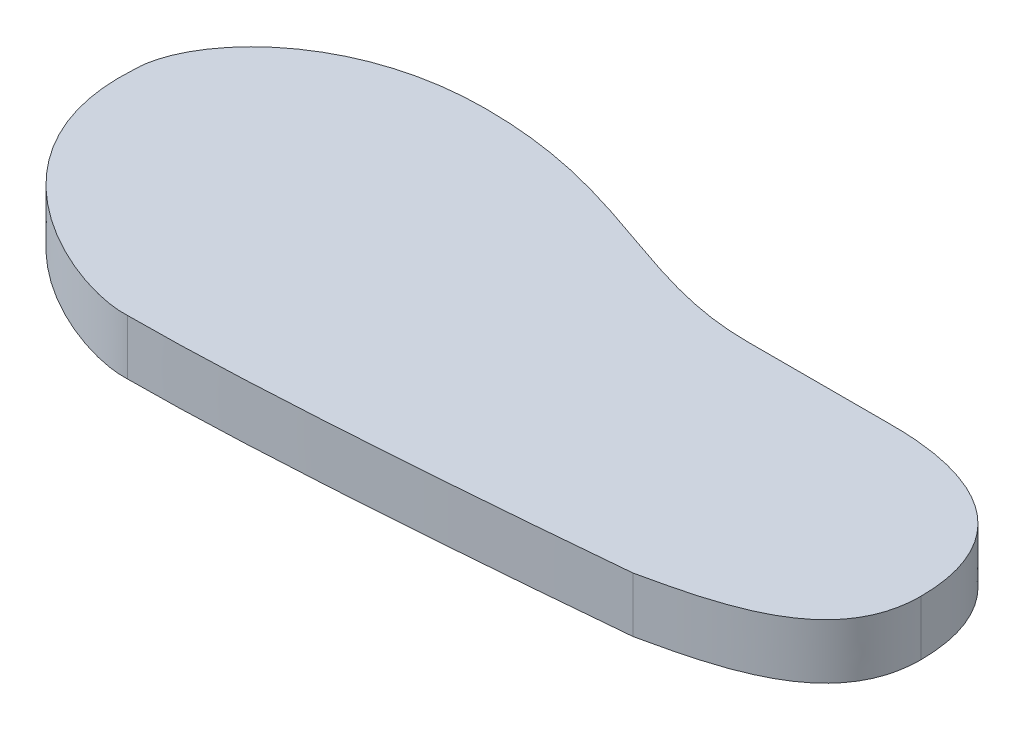
ISO-10303-21;
HEADER;
FILE_DESCRIPTION(('STEP AP214'),'2;1');
FILE_NAME('part.step','',(''),(''),'','','');
FILE_SCHEMA(('AUTOMOTIVE_DESIGN { 1 0 10303 214 1 1 1 1 }'));
ENDSEC;
DATA;
#1=APPLICATION_CONTEXT('core data for automotive mechanical design processes');
#2=APPLICATION_PROTOCOL_DEFINITION('international standard','automotive_design',2000,#1);
#3=PRODUCT_CONTEXT('',#1,'mechanical');
#4=PRODUCT('Part','Part','',(#3));
#5=PRODUCT_RELATED_PRODUCT_CATEGORY('part','',(#4));
#6=PRODUCT_DEFINITION_FORMATION('','',#4);
#7=PRODUCT_DEFINITION_CONTEXT('part definition',#1,'design');
#8=PRODUCT_DEFINITION('design','',#6,#7);
#9=PRODUCT_DEFINITION_SHAPE('','',#8);
#10=(LENGTH_UNIT() NAMED_UNIT(*) SI_UNIT(.MILLI.,.METRE.));
#11=(NAMED_UNIT(*) PLANE_ANGLE_UNIT() SI_UNIT($,.RADIAN.));
#12=(NAMED_UNIT(*) SI_UNIT($,.STERADIAN.) SOLID_ANGLE_UNIT());
#13=UNCERTAINTY_MEASURE_WITH_UNIT(LENGTH_MEASURE(1.E-05),#10,'distance_accuracy_value','');
#14=(GEOMETRIC_REPRESENTATION_CONTEXT(3) GLOBAL_UNCERTAINTY_ASSIGNED_CONTEXT((#13)) GLOBAL_UNIT_ASSIGNED_CONTEXT((#10,
#11,#12)) REPRESENTATION_CONTEXT('',''));
#15=CARTESIAN_POINT('',(0.,0.,0.));
#16=DIRECTION('',(0.,0.,1.));
#17=DIRECTION('',(1.,0.,0.));
#18=AXIS2_PLACEMENT_3D('',#15,#16,#17);
#19=CARTESIAN_POINT('',(-26.,10.,-24.3));
#20=CARTESIAN_POINT('',(-46.3736075901508,10.,-24.3));
#21=CARTESIAN_POINT('',(-60.2233674091947,10.,-37.2));
#22=CARTESIAN_POINT('',(-86.5,10.,-37.2));
#23=B_SPLINE_CURVE_WITH_KNOTS('',3,(#19,#20,#21,#22),.UNSPECIFIED.,.F.,.F.,(4,4),(0.,1.),.UNSPECIFIED.);
#24=DIRECTION('',(0.,-1.,0.));
#25=VECTOR('',#24,1.);
#26=SURFACE_OF_LINEAR_EXTRUSION('',#23,#25);
#27=CARTESIAN_POINT('',(-26.,0.,-24.3));
#28=CARTESIAN_POINT('',(-46.3736075901508,0.,-24.3));
#29=CARTESIAN_POINT('',(-60.2233674091947,0.,-37.2));
#30=CARTESIAN_POINT('',(-86.5,0.,-37.2));
#31=B_SPLINE_CURVE_WITH_KNOTS('',3,(#27,#28,#29,#30),.UNSPECIFIED.,.F.,.F.,(4,4),(0.,1.),.UNSPECIFIED.);
#32=CARTESIAN_POINT('',(-26.,0.,-24.3));
#33=VERTEX_POINT('',#32);
#34=CARTESIAN_POINT('',(-86.5,0.,-37.2));
#35=VERTEX_POINT('',#34);
#36=EDGE_CURVE('E188',#33,#35,#31,.T.);
#37=ORIENTED_EDGE('',*,*,#36,.T.);
#38=DIRECTION('',(0.,-1.,0.));
#39=VECTOR('',#38,1.);
#40=CARTESIAN_POINT('',(-86.5,10.,-37.2));
#41=LINE('',#40,#39);
#42=CARTESIAN_POINT('',(-86.5,10.,-37.2));
#43=VERTEX_POINT('',#42);
#44=EDGE_CURVE('E11',#43,#35,#41,.T.);
#45=ORIENTED_EDGE('',*,*,#44,.F.);
#46=CARTESIAN_POINT('',(-26.,10.,-24.3));
#47=VERTEX_POINT('',#46);
#48=EDGE_CURVE('E164',#47,#43,#23,.T.);
#49=ORIENTED_EDGE('',*,*,#48,.F.);
#50=DIRECTION('',(0.,-1.,0.));
#51=VECTOR('',#50,1.);
#52=CARTESIAN_POINT('',(-26.,10.,-24.3));
#53=LINE('',#52,#51);
#54=EDGE_CURVE('E120',#47,#33,#53,.T.);
#55=ORIENTED_EDGE('',*,*,#54,.T.);
#56=EDGE_LOOP('',(#37,#45,#49,#55));
#57=FACE_BOUND('',#56,.T.);
#58=ADVANCED_FACE('F33',(#57),#26,.F.);
#59=CARTESIAN_POINT('',(-86.5,10.,-37.2));
#60=CARTESIAN_POINT('',(-111.583343569162,10.,-37.2));
#61=CARTESIAN_POINT('',(-124.6,10.,-21.1459181805491));
#62=CARTESIAN_POINT('',(-124.6,10.,-11.6));
#63=B_SPLINE_CURVE_WITH_KNOTS('',3,(#59,#60,#61,#62),.UNSPECIFIED.,.F.,.F.,(4,4),(0.,1.),.UNSPECIFIED.);
#64=DIRECTION('',(0.,-1.,0.));
#65=VECTOR('',#64,1.);
#66=SURFACE_OF_LINEAR_EXTRUSION('',#63,#65);
#67=CARTESIAN_POINT('',(-86.5,0.,-37.2));
#68=CARTESIAN_POINT('',(-111.583343569162,0.,-37.2));
#69=CARTESIAN_POINT('',(-124.6,0.,-21.1459181805491));
#70=CARTESIAN_POINT('',(-124.6,0.,-11.6));
#71=B_SPLINE_CURVE_WITH_KNOTS('',3,(#67,#68,#69,#70),.UNSPECIFIED.,.F.,.F.,(4,4),(0.,1.),.UNSPECIFIED.);
#72=CARTESIAN_POINT('',(-124.6,0.,-11.6));
#73=VERTEX_POINT('',#72);
#74=EDGE_CURVE('E179',#35,#73,#71,.T.);
#75=ORIENTED_EDGE('',*,*,#74,.T.);
#76=DIRECTION('',(0.,-1.,0.));
#77=VECTOR('',#76,1.);
#78=CARTESIAN_POINT('',(-124.6,10.,-11.6));
#79=LINE('',#78,#77);
#80=CARTESIAN_POINT('',(-124.6,10.,-11.6));
#81=VERTEX_POINT('',#80);
#82=EDGE_CURVE('E42',#81,#73,#79,.T.);
#83=ORIENTED_EDGE('',*,*,#82,.F.);
#84=EDGE_CURVE('E90',#43,#81,#63,.T.);
#85=ORIENTED_EDGE('',*,*,#84,.F.);
#86=ORIENTED_EDGE('',*,*,#44,.T.);
#87=EDGE_LOOP('',(#75,#83,#85,#86));
#88=FACE_BOUND('',#87,.T.);
#89=ADVANCED_FACE('F171',(#88),#66,.F.);
#90=CARTESIAN_POINT('',(-124.6,10.,-11.6));
#91=CARTESIAN_POINT('',(-126.645501881538,10.,15.9295647907661));
#92=CARTESIAN_POINT('',(-96.1691643712727,10.,28.4589253460756));
#93=CARTESIAN_POINT('',(-86.5,10.,27.9));
#94=B_SPLINE_CURVE_WITH_KNOTS('',3,(#90,#91,#92,#93),.UNSPECIFIED.,.F.,.F.,(4,4),(0.,1.),.UNSPECIFIED.);
#95=DIRECTION('',(0.,-1.,0.));
#96=VECTOR('',#95,1.);
#97=SURFACE_OF_LINEAR_EXTRUSION('',#94,#96);
#98=CARTESIAN_POINT('',(-124.6,0.,-11.6));
#99=CARTESIAN_POINT('',(-126.645501881538,0.,15.9295647907661));
#100=CARTESIAN_POINT('',(-96.1691643712727,0.,28.4589253460756));
#101=CARTESIAN_POINT('',(-86.5,0.,27.9));
#102=B_SPLINE_CURVE_WITH_KNOTS('',3,(#98,#99,#100,#101),.UNSPECIFIED.,.F.,.F.,(4,4),(0.,1.),.UNSPECIFIED.);
#103=CARTESIAN_POINT('',(-86.5,0.,27.9));
#104=VERTEX_POINT('',#103);
#105=EDGE_CURVE('E187',#73,#104,#102,.T.);
#106=ORIENTED_EDGE('',*,*,#105,.T.);
#107=DIRECTION('',(0.,-1.,0.));
#108=VECTOR('',#107,1.);
#109=CARTESIAN_POINT('',(-86.5,10.,27.9));
#110=LINE('',#109,#108);
#111=CARTESIAN_POINT('',(-86.5,10.,27.9));
#112=VERTEX_POINT('',#111);
#113=EDGE_CURVE('E192',#112,#104,#110,.T.);
#114=ORIENTED_EDGE('',*,*,#113,.F.);
#115=EDGE_CURVE('E150',#81,#112,#94,.T.);
#116=ORIENTED_EDGE('',*,*,#115,.F.);
#117=ORIENTED_EDGE('',*,*,#82,.T.);
#118=EDGE_LOOP('',(#106,#114,#116,#117));
#119=FACE_BOUND('',#118,.T.);
#120=ADVANCED_FACE('F144',(#119),#97,.F.);
#121=CARTESIAN_POINT('',(-86.5,10.,27.9));
#122=CARTESIAN_POINT('',(-58.7425919272787,10.,27.9));
#123=CARTESIAN_POINT('',(0.,10.,22.5));
#124=B_SPLINE_CURVE_WITH_KNOTS('',2,(#121,#122,#123),.UNSPECIFIED.,.F.,.F.,(3,3),(0.,1.),.UNSPECIFIED.);
#125=DIRECTION('',(0.,-1.,0.));
#126=VECTOR('',#125,1.);
#127=SURFACE_OF_LINEAR_EXTRUSION('',#124,#126);
#128=CARTESIAN_POINT('',(-86.5,0.,27.9));
#129=CARTESIAN_POINT('',(-58.7425919272787,0.,27.9));
#130=CARTESIAN_POINT('',(0.,0.,22.5));
#131=B_SPLINE_CURVE_WITH_KNOTS('',2,(#128,#129,#130),.UNSPECIFIED.,.F.,.F.,(3,3),(0.,1.),.UNSPECIFIED.);
#132=CARTESIAN_POINT('',(0.,0.,22.5));
#133=VERTEX_POINT('',#132);
#134=EDGE_CURVE('E195',#104,#133,#131,.T.);
#135=ORIENTED_EDGE('',*,*,#134,.T.);
#136=DIRECTION('',(0.,-1.,0.));
#137=VECTOR('',#136,1.);
#138=CARTESIAN_POINT('',(0.,10.,22.5));
#139=LINE('',#138,#137);
#140=CARTESIAN_POINT('',(0.,10.,22.5));
#141=VERTEX_POINT('',#140);
#142=EDGE_CURVE('E115',#141,#133,#139,.T.);
#143=ORIENTED_EDGE('',*,*,#142,.F.);
#144=EDGE_CURVE('E106',#112,#141,#124,.T.);
#145=ORIENTED_EDGE('',*,*,#144,.F.);
#146=ORIENTED_EDGE('',*,*,#113,.T.);
#147=EDGE_LOOP('',(#135,#143,#145,#146));
#148=FACE_BOUND('',#147,.T.);
#149=ADVANCED_FACE('F141',(#148),#127,.F.);
#150=CARTESIAN_POINT('',(0.,10.,22.5));
#151=CARTESIAN_POINT('',(12.7937826522867,10.,19.673675203613));
#152=CARTESIAN_POINT('',(29.8,10.,15.9033856721984));
#153=CARTESIAN_POINT('',(29.8,10.,0.));
#154=B_SPLINE_CURVE_WITH_KNOTS('',3,(#150,#151,#152,#153),.UNSPECIFIED.,.F.,.F.,(4,4),(0.,1.),.UNSPECIFIED.);
#155=DIRECTION('',(0.,-1.,0.));
#156=VECTOR('',#155,1.);
#157=SURFACE_OF_LINEAR_EXTRUSION('',#154,#156);
#158=CARTESIAN_POINT('',(0.,0.,22.5));
#159=CARTESIAN_POINT('',(12.7937826522867,0.,19.673675203613));
#160=CARTESIAN_POINT('',(29.8,0.,15.9033856721984));
#161=CARTESIAN_POINT('',(29.8,0.,0.));
#162=B_SPLINE_CURVE_WITH_KNOTS('',3,(#158,#159,#160,#161),.UNSPECIFIED.,.F.,.F.,(4,4),(0.,1.),.UNSPECIFIED.);
#163=CARTESIAN_POINT('',(29.8,0.,0.));
#164=VERTEX_POINT('',#163);
#165=EDGE_CURVE('E114',#133,#164,#162,.T.);
#166=ORIENTED_EDGE('',*,*,#165,.T.);
#167=DIRECTION('',(0.,-1.,0.));
#168=VECTOR('',#167,1.);
#169=CARTESIAN_POINT('',(29.8,10.,0.));
#170=LINE('',#169,#168);
#171=CARTESIAN_POINT('',(29.8,10.,0.));
#172=VERTEX_POINT('',#171);
#173=EDGE_CURVE('E111',#172,#164,#170,.T.);
#174=ORIENTED_EDGE('',*,*,#173,.F.);
#175=EDGE_CURVE('E100',#141,#172,#154,.T.);
#176=ORIENTED_EDGE('',*,*,#175,.F.);
#177=ORIENTED_EDGE('',*,*,#142,.T.);
#178=EDGE_LOOP('',(#166,#174,#176,#177));
#179=FACE_BOUND('',#178,.T.);
#180=ADVANCED_FACE('F112',(#179),#157,.F.);
#181=CARTESIAN_POINT('',(29.8,10.,0.));
#182=CARTESIAN_POINT('',(29.8,10.,-14.0989616041096));
#183=CARTESIAN_POINT('',(20.6838322885155,10.,-24.3847138108634));
#184=CARTESIAN_POINT('',(0.,10.,-24.3));
#185=B_SPLINE_CURVE_WITH_KNOTS('',3,(#181,#182,#183,#184),.UNSPECIFIED.,.F.,.F.,(4,4),(0.,1.),.UNSPECIFIED.);
#186=DIRECTION('',(0.,-1.,0.));
#187=VECTOR('',#186,1.);
#188=SURFACE_OF_LINEAR_EXTRUSION('',#185,#187);
#189=CARTESIAN_POINT('',(29.8,0.,0.));
#190=CARTESIAN_POINT('',(29.8,0.,-14.0989616041096));
#191=CARTESIAN_POINT('',(20.6838322885155,0.,-24.3847138108634));
#192=CARTESIAN_POINT('',(0.,0.,-24.3));
#193=B_SPLINE_CURVE_WITH_KNOTS('',3,(#189,#190,#191,#192),.UNSPECIFIED.,.F.,.F.,(4,4),(0.,1.),.UNSPECIFIED.);
#194=CARTESIAN_POINT('',(0.,0.,-24.3));
#195=VERTEX_POINT('',#194);
#196=EDGE_CURVE('E76',#164,#195,#193,.T.);
#197=ORIENTED_EDGE('',*,*,#196,.T.);
#198=DIRECTION('',(0.,-1.,0.));
#199=VECTOR('',#198,1.);
#200=CARTESIAN_POINT('',(0.,10.,-24.3));
#201=LINE('',#200,#199);
#202=CARTESIAN_POINT('',(0.,10.,-24.3));
#203=VERTEX_POINT('',#202);
#204=EDGE_CURVE('E116',#203,#195,#201,.T.);
#205=ORIENTED_EDGE('',*,*,#204,.F.);
#206=EDGE_CURVE('E104',#172,#203,#185,.T.);
#207=ORIENTED_EDGE('',*,*,#206,.F.);
#208=ORIENTED_EDGE('',*,*,#173,.T.);
#209=EDGE_LOOP('',(#197,#205,#207,#208));
#210=FACE_BOUND('',#209,.T.);
#211=ADVANCED_FACE('F118',(#210),#188,.F.);
#212=CARTESIAN_POINT('',(-26.,10.,-24.3));
#213=DIRECTION('',(0.,0.,1.));
#214=DIRECTION('',(1.,0.,0.));
#215=AXIS2_PLACEMENT_3D('',#212,#213,#214);
#216=PLANE('',#215);
#217=DIRECTION('',(-1.,0.,0.));
#218=VECTOR('',#217,1.);
#219=CARTESIAN_POINT('',(-26.,0.,-24.3));
#220=LINE('',#219,#218);
#221=EDGE_CURVE('E82',#195,#33,#220,.T.);
#222=ORIENTED_EDGE('',*,*,#221,.T.);
#223=ORIENTED_EDGE('',*,*,#54,.F.);
#224=DIRECTION('',(-1.,0.,0.));
#225=VECTOR('',#224,1.);
#226=CARTESIAN_POINT('',(-26.,10.,-24.3));
#227=LINE('',#226,#225);
#228=EDGE_CURVE('E50',#203,#47,#227,.T.);
#229=ORIENTED_EDGE('',*,*,#228,.F.);
#230=ORIENTED_EDGE('',*,*,#204,.T.);
#231=EDGE_LOOP('',(#222,#223,#229,#230));
#232=FACE_BOUND('',#231,.T.);
#233=ADVANCED_FACE('F137',(#232),#216,.F.);
#234=CARTESIAN_POINT('',(-54.0363656247546,10.,-30.75));
#235=DIRECTION('',(0.,1.,0.));
#236=DIRECTION('',(0.,0.,1.));
#237=AXIS2_PLACEMENT_3D('',#234,#235,#236);
#238=PLANE('',#237);
#239=ORIENTED_EDGE('',*,*,#48,.T.);
#240=ORIENTED_EDGE('',*,*,#84,.T.);
#241=ORIENTED_EDGE('',*,*,#115,.T.);
#242=ORIENTED_EDGE('',*,*,#144,.T.);
#243=ORIENTED_EDGE('',*,*,#175,.T.);
#244=ORIENTED_EDGE('',*,*,#206,.T.);
#245=ORIENTED_EDGE('',*,*,#228,.T.);
#246=EDGE_LOOP('',(#239,#240,#241,#242,#243,#244,#245));
#247=FACE_BOUND('',#246,.T.);
#248=ADVANCED_FACE('F102',(#247),#238,.T.);
#249=CARTESIAN_POINT('',(-54.0363656247546,0.,-30.75));
#250=DIRECTION('',(0.,1.,0.));
#251=DIRECTION('',(0.,0.,1.));
#252=AXIS2_PLACEMENT_3D('',#249,#250,#251);
#253=PLANE('',#252);
#254=ORIENTED_EDGE('',*,*,#36,.F.);
#255=ORIENTED_EDGE('',*,*,#221,.F.);
#256=ORIENTED_EDGE('',*,*,#196,.F.);
#257=ORIENTED_EDGE('',*,*,#165,.F.);
#258=ORIENTED_EDGE('',*,*,#134,.F.);
#259=ORIENTED_EDGE('',*,*,#105,.F.);
#260=ORIENTED_EDGE('',*,*,#74,.F.);
#261=EDGE_LOOP('',(#254,#255,#256,#257,#258,#259,#260));
#262=FACE_BOUND('',#261,.T.);
#263=ADVANCED_FACE('F194',(#262),#253,.F.);
#264=CLOSED_SHELL('',(#58,#89,#120,#149,#180,#211,#233,#248,#263));
#265=MANIFOLD_SOLID_BREP('B2',#264);
#266=ADVANCED_BREP_SHAPE_REPRESENTATION('',(#18,#265),#14);
#267=SHAPE_DEFINITION_REPRESENTATION(#9,#266);
ENDSEC;
END-ISO-10303-21;
